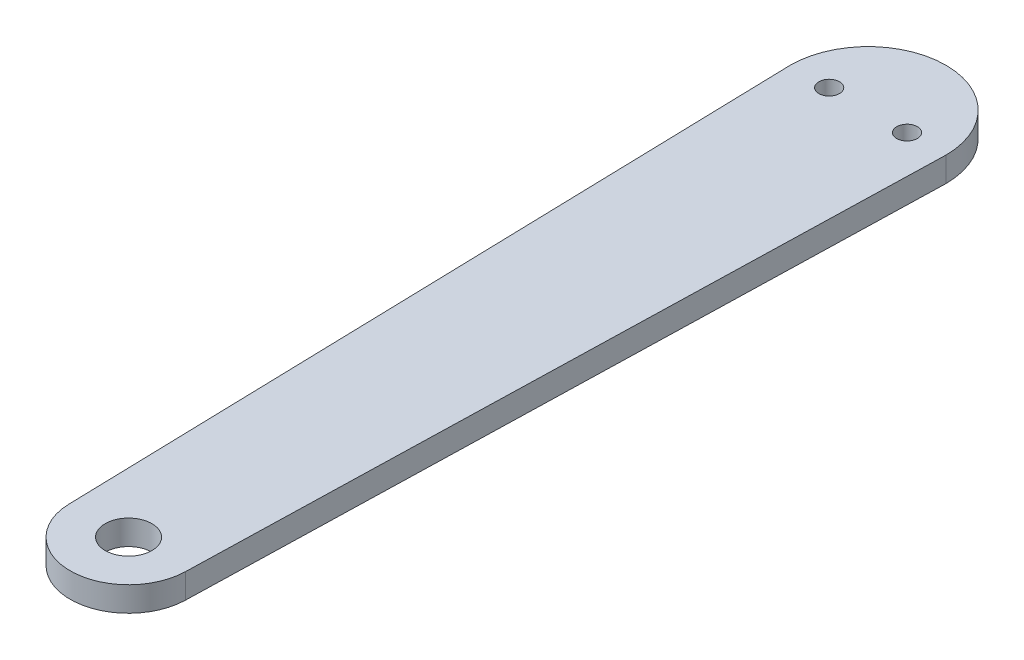
ISO-10303-21;
HEADER;
FILE_DESCRIPTION(('STEP AP214'),'2;1');
FILE_NAME('part.step','',(''),(''),'','','');
FILE_SCHEMA(('AUTOMOTIVE_DESIGN { 1 0 10303 214 1 1 1 1 }'));
ENDSEC;
DATA;
#1=APPLICATION_CONTEXT('core data for automotive mechanical design processes');
#2=APPLICATION_PROTOCOL_DEFINITION('international standard','automotive_design',2000,#1);
#3=PRODUCT_CONTEXT('',#1,'mechanical');
#4=PRODUCT('Part','Part','',(#3));
#5=PRODUCT_RELATED_PRODUCT_CATEGORY('part','',(#4));
#6=PRODUCT_DEFINITION_FORMATION('','',#4);
#7=PRODUCT_DEFINITION_CONTEXT('part definition',#1,'design');
#8=PRODUCT_DEFINITION('design','',#6,#7);
#9=PRODUCT_DEFINITION_SHAPE('','',#8);
#10=(LENGTH_UNIT() NAMED_UNIT(*) SI_UNIT(.MILLI.,.METRE.));
#11=(NAMED_UNIT(*) PLANE_ANGLE_UNIT() SI_UNIT($,.RADIAN.));
#12=(NAMED_UNIT(*) SI_UNIT($,.STERADIAN.) SOLID_ANGLE_UNIT());
#13=UNCERTAINTY_MEASURE_WITH_UNIT(LENGTH_MEASURE(1.E-05),#10,'distance_accuracy_value','');
#14=(GEOMETRIC_REPRESENTATION_CONTEXT(3) GLOBAL_UNCERTAINTY_ASSIGNED_CONTEXT((#13)) GLOBAL_UNIT_ASSIGNED_CONTEXT((#10,
#11,#12)) REPRESENTATION_CONTEXT('',''));
#15=CARTESIAN_POINT('',(0.,0.,0.));
#16=DIRECTION('',(0.,0.,1.));
#17=DIRECTION('',(1.,0.,0.));
#18=AXIS2_PLACEMENT_3D('',#15,#16,#17);
#19=CARTESIAN_POINT('',(0.,6.35,0.));
#20=DIRECTION('',(0.,-1.,0.));
#21=DIRECTION('',(0.,0.,-1.));
#22=AXIS2_PLACEMENT_3D('',#19,#20,#21);
#23=PLANE('',#22);
#24=CARTESIAN_POINT('',(-10.,6.35,0.));
#25=DIRECTION('',(0.,1.,0.));
#26=DIRECTION('',(0.,0.,1.));
#27=AXIS2_PLACEMENT_3D('',#24,#25,#26);
#28=CIRCLE('',#27,2.64999999999999);
#29=CARTESIAN_POINT('',(-10.,6.35,2.64999999999999));
#30=VERTEX_POINT('',#29);
#31=EDGE_CURVE('E129',#30,#30,#28,.T.);
#32=ORIENTED_EDGE('',*,*,#31,.F.);
#33=EDGE_LOOP('',(#32));
#34=FACE_BOUND('',#33,.T.);
#35=CARTESIAN_POINT('',(10.,6.35,0.));
#36=DIRECTION('',(0.,1.,0.));
#37=DIRECTION('',(0.,0.,1.));
#38=AXIS2_PLACEMENT_3D('',#35,#36,#37);
#39=CIRCLE('',#38,2.64999999999999);
#40=CARTESIAN_POINT('',(10.,6.35,2.64999999999999));
#41=VERTEX_POINT('',#40);
#42=EDGE_CURVE('E123',#41,#41,#39,.T.);
#43=ORIENTED_EDGE('',*,*,#42,.F.);
#44=EDGE_LOOP('',(#43));
#45=FACE_BOUND('',#44,.T.);
#46=CARTESIAN_POINT('',(0.,6.35,0.));
#47=DIRECTION('',(0.,1.,0.));
#48=DIRECTION('',(0.,0.,-1.));
#49=AXIS2_PLACEMENT_3D('',#46,#47,#48);
#50=CIRCLE('',#49,20.);
#51=CARTESIAN_POINT('',(20.,6.35,0.));
#52=VERTEX_POINT('',#51);
#53=CARTESIAN_POINT('',(-20.,6.35,0.));
#54=VERTEX_POINT('',#53);
#55=EDGE_CURVE('E88',#52,#54,#50,.T.);
#56=ORIENTED_EDGE('',*,*,#55,.T.);
#57=DIRECTION('',(0.0262794353684428,0.,0.999654636000212));
#58=VECTOR('',#57,1.);
#59=CARTESIAN_POINT('',(-20.,6.35,0.));
#60=LINE('',#59,#58);
#61=CARTESIAN_POINT('',(-14.9948195400033,6.35,190.394191530527));
#62=VERTEX_POINT('',#61);
#63=EDGE_CURVE('E83',#54,#62,#60,.T.);
#64=ORIENTED_EDGE('',*,*,#63,.T.);
#65=CARTESIAN_POINT('',(0.,6.35,190.));
#66=DIRECTION('',(0.,1.,0.));
#67=DIRECTION('',(0.,0.,1.));
#68=AXIS2_PLACEMENT_3D('',#65,#66,#67);
#69=CIRCLE('',#68,15.);
#70=CARTESIAN_POINT('',(14.9948195400031,6.35,190.394191530527));
#71=VERTEX_POINT('',#70);
#72=EDGE_CURVE('E86',#62,#71,#69,.T.);
#73=ORIENTED_EDGE('',*,*,#72,.T.);
#74=DIRECTION('',(0.0262794353684434,0.,-0.999654636000212));
#75=VECTOR('',#74,1.);
#76=CARTESIAN_POINT('',(20.,6.35,0.));
#77=LINE('',#76,#75);
#78=EDGE_CURVE('E53',#71,#52,#77,.T.);
#79=ORIENTED_EDGE('',*,*,#78,.T.);
#80=EDGE_LOOP('',(#56,#64,#73,#79));
#81=FACE_BOUND('',#80,.T.);
#82=CARTESIAN_POINT('',(0.,6.35,190.));
#83=DIRECTION('',(0.,1.,0.));
#84=DIRECTION('',(0.,0.,1.));
#85=AXIS2_PLACEMENT_3D('',#82,#83,#84);
#86=CIRCLE('',#85,6.00000000000001);
#87=CARTESIAN_POINT('',(0.,6.35,196.));
#88=VERTEX_POINT('',#87);
#89=EDGE_CURVE('E103',#88,#88,#86,.T.);
#90=ORIENTED_EDGE('',*,*,#89,.F.);
#91=EDGE_LOOP('',(#90));
#92=FACE_BOUND('',#91,.T.);
#93=ADVANCED_FACE('F36',(#34,#45,#81,#92),#23,.F.);
#94=CARTESIAN_POINT('',(0.,0.,0.));
#95=DIRECTION('',(0.,-1.,0.));
#96=DIRECTION('',(0.,0.,-1.));
#97=AXIS2_PLACEMENT_3D('',#94,#95,#96);
#98=PLANE('',#97);
#99=CARTESIAN_POINT('',(-10.,0.,0.));
#100=DIRECTION('',(0.,1.,0.));
#101=DIRECTION('',(0.,0.,1.));
#102=AXIS2_PLACEMENT_3D('',#99,#100,#101);
#103=CIRCLE('',#102,2.65);
#104=CARTESIAN_POINT('',(-10.,0.,2.65));
#105=VERTEX_POINT('',#104);
#106=EDGE_CURVE('E126',#105,#105,#103,.T.);
#107=ORIENTED_EDGE('',*,*,#106,.T.);
#108=EDGE_LOOP('',(#107));
#109=FACE_BOUND('',#108,.T.);
#110=CARTESIAN_POINT('',(10.,0.,0.));
#111=DIRECTION('',(0.,1.,0.));
#112=DIRECTION('',(0.,0.,1.));
#113=AXIS2_PLACEMENT_3D('',#110,#111,#112);
#114=CIRCLE('',#113,2.65);
#115=CARTESIAN_POINT('',(10.,0.,2.65));
#116=VERTEX_POINT('',#115);
#117=EDGE_CURVE('E118',#116,#116,#114,.T.);
#118=ORIENTED_EDGE('',*,*,#117,.T.);
#119=EDGE_LOOP('',(#118));
#120=FACE_BOUND('',#119,.T.);
#121=CARTESIAN_POINT('',(0.,0.,0.));
#122=DIRECTION('',(0.,1.,0.));
#123=DIRECTION('',(0.,0.,-1.));
#124=AXIS2_PLACEMENT_3D('',#121,#122,#123);
#125=CIRCLE('',#124,20.);
#126=CARTESIAN_POINT('',(20.,0.,0.));
#127=VERTEX_POINT('',#126);
#128=CARTESIAN_POINT('',(-20.,0.,0.));
#129=VERTEX_POINT('',#128);
#130=EDGE_CURVE('E100',#127,#129,#125,.T.);
#131=ORIENTED_EDGE('',*,*,#130,.F.);
#132=DIRECTION('',(0.0262794353684434,0.,-0.999654636000212));
#133=VECTOR('',#132,1.);
#134=CARTESIAN_POINT('',(20.,0.,0.));
#135=LINE('',#134,#133);
#136=CARTESIAN_POINT('',(14.9948195400031,0.,190.394191530527));
#137=VERTEX_POINT('',#136);
#138=EDGE_CURVE('E76',#137,#127,#135,.T.);
#139=ORIENTED_EDGE('',*,*,#138,.F.);
#140=CARTESIAN_POINT('',(0.,0.,190.));
#141=DIRECTION('',(0.,1.,0.));
#142=DIRECTION('',(0.,0.,1.));
#143=AXIS2_PLACEMENT_3D('',#140,#141,#142);
#144=CIRCLE('',#143,15.);
#145=CARTESIAN_POINT('',(-14.9948195400033,0.,190.394191530527));
#146=VERTEX_POINT('',#145);
#147=EDGE_CURVE('E70',#146,#137,#144,.T.);
#148=ORIENTED_EDGE('',*,*,#147,.F.);
#149=DIRECTION('',(0.0262794353684428,0.,0.999654636000212));
#150=VECTOR('',#149,1.);
#151=CARTESIAN_POINT('',(-20.,0.,0.));
#152=LINE('',#151,#150);
#153=EDGE_CURVE('E92',#129,#146,#152,.T.);
#154=ORIENTED_EDGE('',*,*,#153,.F.);
#155=EDGE_LOOP('',(#131,#139,#148,#154));
#156=FACE_BOUND('',#155,.T.);
#157=CARTESIAN_POINT('',(0.,0.,190.));
#158=DIRECTION('',(0.,1.,0.));
#159=DIRECTION('',(0.,0.,1.));
#160=AXIS2_PLACEMENT_3D('',#157,#158,#159);
#161=CIRCLE('',#160,6.00000000000001);
#162=CARTESIAN_POINT('',(0.,0.,196.));
#163=VERTEX_POINT('',#162);
#164=EDGE_CURVE('E115',#163,#163,#161,.T.);
#165=ORIENTED_EDGE('',*,*,#164,.T.);
#166=EDGE_LOOP('',(#165));
#167=FACE_BOUND('',#166,.T.);
#168=ADVANCED_FACE('F111',(#109,#120,#156,#167),#98,.T.);
#169=CARTESIAN_POINT('',(0.,6.35,0.));
#170=DIRECTION('',(0.,-1.,0.));
#171=DIRECTION('',(0.,0.,-1.));
#172=AXIS2_PLACEMENT_3D('',#169,#170,#171);
#173=CYLINDRICAL_SURFACE('',#172,20.);
#174=ORIENTED_EDGE('',*,*,#130,.T.);
#175=DIRECTION('',(0.,-1.,0.));
#176=VECTOR('',#175,1.);
#177=CARTESIAN_POINT('',(-20.,6.35,0.));
#178=LINE('',#177,#176);
#179=EDGE_CURVE('E11',#54,#129,#178,.T.);
#180=ORIENTED_EDGE('',*,*,#179,.F.);
#181=ORIENTED_EDGE('',*,*,#55,.F.);
#182=DIRECTION('',(0.,-1.,0.));
#183=VECTOR('',#182,1.);
#184=CARTESIAN_POINT('',(20.,6.35,0.));
#185=LINE('',#184,#183);
#186=EDGE_CURVE('E96',#52,#127,#185,.T.);
#187=ORIENTED_EDGE('',*,*,#186,.T.);
#188=EDGE_LOOP('',(#174,#180,#181,#187));
#189=FACE_BOUND('',#188,.T.);
#190=ADVANCED_FACE('F38',(#189),#173,.T.);
#191=CARTESIAN_POINT('',(-20.,6.35,0.));
#192=DIRECTION('',(0.999654636000212,0.,-0.0262794353684428));
#193=DIRECTION('',(-0.0262794353684428,0.,-0.999654636000212));
#194=AXIS2_PLACEMENT_3D('',#191,#192,#193);
#195=PLANE('',#194);
#196=ORIENTED_EDGE('',*,*,#153,.T.);
#197=DIRECTION('',(0.,-1.,0.));
#198=VECTOR('',#197,1.);
#199=CARTESIAN_POINT('',(-14.9948195400033,6.35,190.394191530527));
#200=LINE('',#199,#198);
#201=EDGE_CURVE('E45',#62,#146,#200,.T.);
#202=ORIENTED_EDGE('',*,*,#201,.F.);
#203=ORIENTED_EDGE('',*,*,#63,.F.);
#204=ORIENTED_EDGE('',*,*,#179,.T.);
#205=EDGE_LOOP('',(#196,#202,#203,#204));
#206=FACE_BOUND('',#205,.T.);
#207=ADVANCED_FACE('F91',(#206),#195,.F.);
#208=CARTESIAN_POINT('',(0.,6.35,190.));
#209=DIRECTION('',(0.,-1.,0.));
#210=DIRECTION('',(0.,0.,-1.));
#211=AXIS2_PLACEMENT_3D('',#208,#209,#210);
#212=CYLINDRICAL_SURFACE('',#211,15.);
#213=ORIENTED_EDGE('',*,*,#147,.T.);
#214=DIRECTION('',(0.,-1.,0.));
#215=VECTOR('',#214,1.);
#216=CARTESIAN_POINT('',(14.9948195400031,6.35,190.394191530527));
#217=LINE('',#216,#215);
#218=EDGE_CURVE('E93',#71,#137,#217,.T.);
#219=ORIENTED_EDGE('',*,*,#218,.F.);
#220=ORIENTED_EDGE('',*,*,#72,.F.);
#221=ORIENTED_EDGE('',*,*,#201,.T.);
#222=EDGE_LOOP('',(#213,#219,#220,#221));
#223=FACE_BOUND('',#222,.T.);
#224=ADVANCED_FACE('F94',(#223),#212,.T.);
#225=CARTESIAN_POINT('',(20.,6.35,0.));
#226=DIRECTION('',(-0.999654636000212,0.,-0.0262794353684434));
#227=DIRECTION('',(-0.0262794353684434,0.,0.999654636000212));
#228=AXIS2_PLACEMENT_3D('',#225,#226,#227);
#229=PLANE('',#228);
#230=ORIENTED_EDGE('',*,*,#138,.T.);
#231=ORIENTED_EDGE('',*,*,#186,.F.);
#232=ORIENTED_EDGE('',*,*,#78,.F.);
#233=ORIENTED_EDGE('',*,*,#218,.T.);
#234=EDGE_LOOP('',(#230,#231,#232,#233));
#235=FACE_BOUND('',#234,.T.);
#236=ADVANCED_FACE('F108',(#235),#229,.F.);
#237=CARTESIAN_POINT('',(0.,6.35,190.));
#238=DIRECTION('',(0.,-1.,0.));
#239=DIRECTION('',(0.,0.,-1.));
#240=AXIS2_PLACEMENT_3D('',#237,#238,#239);
#241=CYLINDRICAL_SURFACE('',#240,6.00000000000001);
#242=ORIENTED_EDGE('',*,*,#89,.T.);
#243=EDGE_LOOP('',(#242));
#244=FACE_BOUND('',#243,.T.);
#245=ORIENTED_EDGE('',*,*,#164,.F.);
#246=EDGE_LOOP('',(#245));
#247=FACE_BOUND('',#246,.T.);
#248=ADVANCED_FACE('F142',(#244,#247),#241,.F.);
#249=CARTESIAN_POINT('',(10.,6.35,0.));
#250=DIRECTION('',(0.,1.,0.));
#251=DIRECTION('',(0.,0.,1.));
#252=AXIS2_PLACEMENT_3D('',#249,#250,#251);
#253=CYLINDRICAL_SURFACE('',#252,2.64999999999999);
#254=ORIENTED_EDGE('',*,*,#117,.F.);
#255=EDGE_LOOP('',(#254));
#256=FACE_BOUND('',#255,.T.);
#257=ORIENTED_EDGE('',*,*,#42,.T.);
#258=EDGE_LOOP('',(#257));
#259=FACE_BOUND('',#258,.T.);
#260=ADVANCED_FACE('F140',(#256,#259),#253,.F.);
#261=CARTESIAN_POINT('',(-10.,6.35,0.));
#262=DIRECTION('',(0.,1.,0.));
#263=DIRECTION('',(0.,0.,1.));
#264=AXIS2_PLACEMENT_3D('',#261,#262,#263);
#265=CYLINDRICAL_SURFACE('',#264,2.64999999999999);
#266=ORIENTED_EDGE('',*,*,#106,.F.);
#267=EDGE_LOOP('',(#266));
#268=FACE_BOUND('',#267,.T.);
#269=ORIENTED_EDGE('',*,*,#31,.T.);
#270=EDGE_LOOP('',(#269));
#271=FACE_BOUND('',#270,.T.);
#272=ADVANCED_FACE('F133',(#268,#271),#265,.F.);
#273=CLOSED_SHELL('',(#93,#168,#190,#207,#224,#236,#248,#260,#272));
#274=MANIFOLD_SOLID_BREP('B2',#273);
#275=ADVANCED_BREP_SHAPE_REPRESENTATION('',(#18,#274),#14);
#276=SHAPE_DEFINITION_REPRESENTATION(#9,#275);
ENDSEC;
END-ISO-10303-21;
